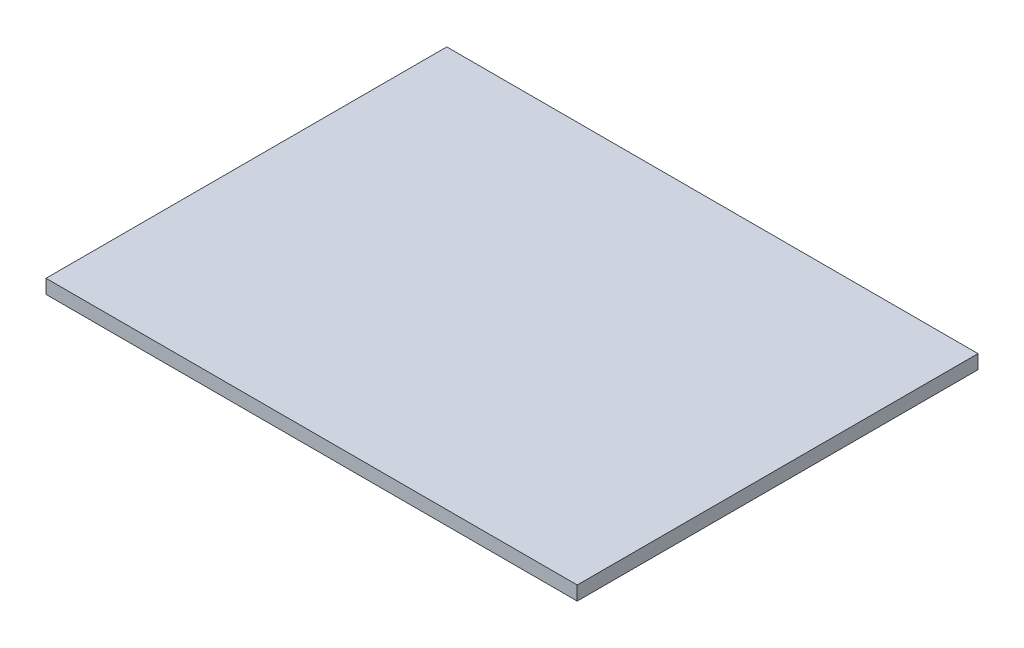
ISO-10303-21;
HEADER;
FILE_DESCRIPTION(('STEP AP214'),'2;1');
FILE_NAME('part.step','',(''),(''),'','','');
FILE_SCHEMA(('AUTOMOTIVE_DESIGN { 1 0 10303 214 1 1 1 1 }'));
ENDSEC;
DATA;
#1=APPLICATION_CONTEXT('core data for automotive mechanical design processes');
#2=APPLICATION_PROTOCOL_DEFINITION('international standard','automotive_design',2000,#1);
#3=PRODUCT_CONTEXT('',#1,'mechanical');
#4=PRODUCT('Part','Part','',(#3));
#5=PRODUCT_RELATED_PRODUCT_CATEGORY('part','',(#4));
#6=PRODUCT_DEFINITION_FORMATION('','',#4);
#7=PRODUCT_DEFINITION_CONTEXT('part definition',#1,'design');
#8=PRODUCT_DEFINITION('design','',#6,#7);
#9=PRODUCT_DEFINITION_SHAPE('','',#8);
#10=(LENGTH_UNIT() NAMED_UNIT(*) SI_UNIT(.MILLI.,.METRE.));
#11=(NAMED_UNIT(*) PLANE_ANGLE_UNIT() SI_UNIT($,.RADIAN.));
#12=(NAMED_UNIT(*) SI_UNIT($,.STERADIAN.) SOLID_ANGLE_UNIT());
#13=UNCERTAINTY_MEASURE_WITH_UNIT(LENGTH_MEASURE(1.E-05),#10,'distance_accuracy_value','');
#14=(GEOMETRIC_REPRESENTATION_CONTEXT(3) GLOBAL_UNCERTAINTY_ASSIGNED_CONTEXT((#13)) GLOBAL_UNIT_ASSIGNED_CONTEXT((#10,
#11,#12)) REPRESENTATION_CONTEXT('',''));
#15=CARTESIAN_POINT('',(0.,0.,0.));
#16=DIRECTION('',(0.,0.,1.));
#17=DIRECTION('',(1.,0.,0.));
#18=AXIS2_PLACEMENT_3D('',#15,#16,#17);
#19=CARTESIAN_POINT('',(0.,4.7625,0.));
#20=DIRECTION('',(1.,0.,0.));
#21=DIRECTION('',(0.,0.,-1.));
#22=AXIS2_PLACEMENT_3D('',#19,#20,#21);
#23=PLANE('',#22);
#24=DIRECTION('',(0.,0.,1.));
#25=VECTOR('',#24,1.);
#26=CARTESIAN_POINT('',(0.,0.,0.));
#27=LINE('',#26,#25);
#28=CARTESIAN_POINT('',(0.,0.,0.));
#29=VERTEX_POINT('',#28);
#30=CARTESIAN_POINT('',(0.,0.,136.525));
#31=VERTEX_POINT('',#30);
#32=EDGE_CURVE('E96',#29,#31,#27,.T.);
#33=ORIENTED_EDGE('',*,*,#32,.T.);
#34=DIRECTION('',(0.,-1.,0.));
#35=VECTOR('',#34,1.);
#36=CARTESIAN_POINT('',(0.,4.7625,136.525));
#37=LINE('',#36,#35);
#38=CARTESIAN_POINT('',(0.,4.7625,136.525));
#39=VERTEX_POINT('',#38);
#40=EDGE_CURVE('E11',#39,#31,#37,.T.);
#41=ORIENTED_EDGE('',*,*,#40,.F.);
#42=DIRECTION('',(0.,0.,1.));
#43=VECTOR('',#42,1.);
#44=CARTESIAN_POINT('',(0.,4.7625,0.));
#45=LINE('',#44,#43);
#46=CARTESIAN_POINT('',(0.,4.7625,0.));
#47=VERTEX_POINT('',#46);
#48=EDGE_CURVE('E82',#47,#39,#45,.T.);
#49=ORIENTED_EDGE('',*,*,#48,.F.);
#50=DIRECTION('',(0.,-1.,0.));
#51=VECTOR('',#50,1.);
#52=CARTESIAN_POINT('',(0.,4.7625,0.));
#53=LINE('',#52,#51);
#54=EDGE_CURVE('E49',#47,#29,#53,.T.);
#55=ORIENTED_EDGE('',*,*,#54,.T.);
#56=EDGE_LOOP('',(#33,#41,#49,#55));
#57=FACE_BOUND('',#56,.T.);
#58=ADVANCED_FACE('F33',(#57),#23,.F.);
#59=CARTESIAN_POINT('',(0.,4.7625,136.525));
#60=DIRECTION('',(0.,0.,-1.));
#61=DIRECTION('',(-1.,0.,0.));
#62=AXIS2_PLACEMENT_3D('',#59,#60,#61);
#63=PLANE('',#62);
#64=DIRECTION('',(1.,0.,0.));
#65=VECTOR('',#64,1.);
#66=CARTESIAN_POINT('',(0.,0.,136.525));
#67=LINE('',#66,#65);
#68=CARTESIAN_POINT('',(180.975,0.,136.525));
#69=VERTEX_POINT('',#68);
#70=EDGE_CURVE('E87',#31,#69,#67,.T.);
#71=ORIENTED_EDGE('',*,*,#70,.T.);
#72=DIRECTION('',(0.,-1.,0.));
#73=VECTOR('',#72,1.);
#74=CARTESIAN_POINT('',(180.975,4.7625,136.525));
#75=LINE('',#74,#73);
#76=CARTESIAN_POINT('',(180.975,4.7625,136.525));
#77=VERTEX_POINT('',#76);
#78=EDGE_CURVE('E41',#77,#69,#75,.T.);
#79=ORIENTED_EDGE('',*,*,#78,.F.);
#80=DIRECTION('',(1.,0.,0.));
#81=VECTOR('',#80,1.);
#82=CARTESIAN_POINT('',(0.,4.7625,136.525));
#83=LINE('',#82,#81);
#84=EDGE_CURVE('E74',#39,#77,#83,.T.);
#85=ORIENTED_EDGE('',*,*,#84,.F.);
#86=ORIENTED_EDGE('',*,*,#40,.T.);
#87=EDGE_LOOP('',(#71,#79,#85,#86));
#88=FACE_BOUND('',#87,.T.);
#89=ADVANCED_FACE('F86',(#88),#63,.F.);
#90=CARTESIAN_POINT('',(180.975,4.7625,0.));
#91=DIRECTION('',(1.,0.,0.));
#92=DIRECTION('',(0.,0.,-1.));
#93=AXIS2_PLACEMENT_3D('',#90,#91,#92);
#94=PLANE('',#93);
#95=DIRECTION('',(0.,0.,1.));
#96=VECTOR('',#95,1.);
#97=CARTESIAN_POINT('',(180.975,0.,0.));
#98=LINE('',#97,#96);
#99=CARTESIAN_POINT('',(180.975,0.,0.));
#100=VERTEX_POINT('',#99);
#101=EDGE_CURVE('E99',#100,#69,#98,.T.);
#102=ORIENTED_EDGE('',*,*,#101,.F.);
#103=DIRECTION('',(0.,-1.,0.));
#104=VECTOR('',#103,1.);
#105=CARTESIAN_POINT('',(180.975,4.7625,0.));
#106=LINE('',#105,#104);
#107=CARTESIAN_POINT('',(180.975,4.7625,0.));
#108=VERTEX_POINT('',#107);
#109=EDGE_CURVE('E63',#108,#100,#106,.T.);
#110=ORIENTED_EDGE('',*,*,#109,.F.);
#111=DIRECTION('',(0.,0.,1.));
#112=VECTOR('',#111,1.);
#113=CARTESIAN_POINT('',(180.975,4.7625,0.));
#114=LINE('',#113,#112);
#115=EDGE_CURVE('E81',#108,#77,#114,.T.);
#116=ORIENTED_EDGE('',*,*,#115,.T.);
#117=ORIENTED_EDGE('',*,*,#78,.T.);
#118=EDGE_LOOP('',(#102,#110,#116,#117));
#119=FACE_BOUND('',#118,.T.);
#120=ADVANCED_FACE('F90',(#119),#94,.T.);
#121=CARTESIAN_POINT('',(0.,4.7625,0.));
#122=DIRECTION('',(0.,0.,-1.));
#123=DIRECTION('',(-1.,0.,0.));
#124=AXIS2_PLACEMENT_3D('',#121,#122,#123);
#125=PLANE('',#124);
#126=DIRECTION('',(1.,0.,0.));
#127=VECTOR('',#126,1.);
#128=CARTESIAN_POINT('',(0.,0.,0.));
#129=LINE('',#128,#127);
#130=EDGE_CURVE('E101',#29,#100,#129,.T.);
#131=ORIENTED_EDGE('',*,*,#130,.F.);
#132=ORIENTED_EDGE('',*,*,#54,.F.);
#133=DIRECTION('',(1.,0.,0.));
#134=VECTOR('',#133,1.);
#135=CARTESIAN_POINT('',(0.,4.7625,0.));
#136=LINE('',#135,#134);
#137=EDGE_CURVE('E91',#47,#108,#136,.T.);
#138=ORIENTED_EDGE('',*,*,#137,.T.);
#139=ORIENTED_EDGE('',*,*,#109,.T.);
#140=EDGE_LOOP('',(#131,#132,#138,#139));
#141=FACE_BOUND('',#140,.T.);
#142=ADVANCED_FACE('F107',(#141),#125,.T.);
#143=CARTESIAN_POINT('',(0.,4.7625,0.));
#144=DIRECTION('',(0.,1.,0.));
#145=DIRECTION('',(0.,0.,1.));
#146=AXIS2_PLACEMENT_3D('',#143,#144,#145);
#147=PLANE('',#146);
#148=ORIENTED_EDGE('',*,*,#48,.T.);
#149=ORIENTED_EDGE('',*,*,#84,.T.);
#150=ORIENTED_EDGE('',*,*,#115,.F.);
#151=ORIENTED_EDGE('',*,*,#137,.F.);
#152=EDGE_LOOP('',(#148,#149,#150,#151));
#153=FACE_BOUND('',#152,.T.);
#154=ADVANCED_FACE('F78',(#153),#147,.T.);
#155=CARTESIAN_POINT('',(0.,0.,0.));
#156=DIRECTION('',(0.,1.,0.));
#157=DIRECTION('',(0.,0.,1.));
#158=AXIS2_PLACEMENT_3D('',#155,#156,#157);
#159=PLANE('',#158);
#160=ORIENTED_EDGE('',*,*,#32,.F.);
#161=ORIENTED_EDGE('',*,*,#130,.T.);
#162=ORIENTED_EDGE('',*,*,#101,.T.);
#163=ORIENTED_EDGE('',*,*,#70,.F.);
#164=EDGE_LOOP('',(#160,#161,#162,#163));
#165=FACE_BOUND('',#164,.T.);
#166=ADVANCED_FACE('F106',(#165),#159,.F.);
#167=CLOSED_SHELL('',(#58,#89,#120,#142,#154,#166));
#168=MANIFOLD_SOLID_BREP('B2',#167);
#169=ADVANCED_BREP_SHAPE_REPRESENTATION('',(#18,#168),#14);
#170=SHAPE_DEFINITION_REPRESENTATION(#9,#169);
ENDSEC;
END-ISO-10303-21;
